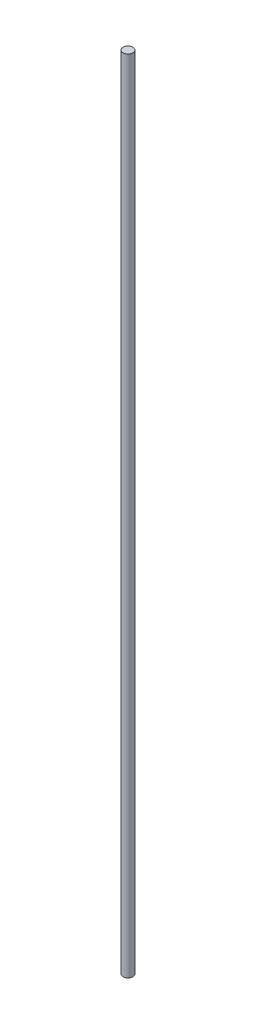
ISO-10303-21;
HEADER;
FILE_DESCRIPTION(('STEP AP214'),'2;1');
FILE_NAME('part.step','',(''),(''),'','','');
FILE_SCHEMA(('AUTOMOTIVE_DESIGN { 1 0 10303 214 1 1 1 1 }'));
ENDSEC;
DATA;
#1=APPLICATION_CONTEXT('core data for automotive mechanical design processes');
#2=APPLICATION_PROTOCOL_DEFINITION('international standard','automotive_design',2000,#1);
#3=PRODUCT_CONTEXT('',#1,'mechanical');
#4=PRODUCT('Part','Part','',(#3));
#5=PRODUCT_RELATED_PRODUCT_CATEGORY('part','',(#4));
#6=PRODUCT_DEFINITION_FORMATION('','',#4);
#7=PRODUCT_DEFINITION_CONTEXT('part definition',#1,'design');
#8=PRODUCT_DEFINITION('design','',#6,#7);
#9=PRODUCT_DEFINITION_SHAPE('','',#8);
#10=(LENGTH_UNIT() NAMED_UNIT(*) SI_UNIT(.MILLI.,.METRE.));
#11=(NAMED_UNIT(*) PLANE_ANGLE_UNIT() SI_UNIT($,.RADIAN.));
#12=(NAMED_UNIT(*) SI_UNIT($,.STERADIAN.) SOLID_ANGLE_UNIT());
#13=UNCERTAINTY_MEASURE_WITH_UNIT(LENGTH_MEASURE(1.E-05),#10,'distance_accuracy_value','');
#14=(GEOMETRIC_REPRESENTATION_CONTEXT(3) GLOBAL_UNCERTAINTY_ASSIGNED_CONTEXT((#13)) GLOBAL_UNIT_ASSIGNED_CONTEXT((#10,
#11,#12)) REPRESENTATION_CONTEXT('',''));
#15=CARTESIAN_POINT('',(0.,0.,0.));
#16=DIRECTION('',(0.,0.,1.));
#17=DIRECTION('',(1.,0.,0.));
#18=AXIS2_PLACEMENT_3D('',#15,#16,#17);
#19=CARTESIAN_POINT('',(0.,650.,0.));
#20=DIRECTION('',(0.,-1.,0.));
#21=DIRECTION('',(0.,0.,-1.));
#22=AXIS2_PLACEMENT_3D('',#19,#20,#21);
#23=CYLINDRICAL_SURFACE('',#22,4.);
#24=CARTESIAN_POINT('',(0.,650.,0.));
#25=DIRECTION('',(0.,1.,0.));
#26=DIRECTION('',(0.,0.,1.));
#27=AXIS2_PLACEMENT_3D('',#24,#25,#26);
#28=CIRCLE('',#27,4.);
#29=CARTESIAN_POINT('',(0.,650.,4.));
#30=VERTEX_POINT('',#29);
#31=EDGE_CURVE('E10',#30,#30,#28,.T.);
#32=ORIENTED_EDGE('',*,*,#31,.F.);
#33=EDGE_LOOP('',(#32));
#34=FACE_BOUND('',#33,.T.);
#35=CARTESIAN_POINT('',(0.,0.,0.));
#36=DIRECTION('',(0.,1.,0.));
#37=DIRECTION('',(0.,0.,1.));
#38=AXIS2_PLACEMENT_3D('',#35,#36,#37);
#39=CIRCLE('',#38,4.);
#40=CARTESIAN_POINT('',(0.,0.,4.));
#41=VERTEX_POINT('',#40);
#42=EDGE_CURVE('E33',#41,#41,#39,.T.);
#43=ORIENTED_EDGE('',*,*,#42,.T.);
#44=EDGE_LOOP('',(#43));
#45=FACE_BOUND('',#44,.T.);
#46=ADVANCED_FACE('F30',(#34,#45),#23,.T.);
#47=CARTESIAN_POINT('',(0.,650.,0.));
#48=DIRECTION('',(0.,1.,0.));
#49=DIRECTION('',(0.,0.,1.));
#50=AXIS2_PLACEMENT_3D('',#47,#48,#49);
#51=PLANE('',#50);
#52=ORIENTED_EDGE('',*,*,#31,.T.);
#53=EDGE_LOOP('',(#52));
#54=FACE_BOUND('',#53,.T.);
#55=ADVANCED_FACE('F45',(#54),#51,.T.);
#56=CARTESIAN_POINT('',(0.,0.,0.));
#57=DIRECTION('',(0.,1.,0.));
#58=DIRECTION('',(0.,0.,1.));
#59=AXIS2_PLACEMENT_3D('',#56,#57,#58);
#60=PLANE('',#59);
#61=ORIENTED_EDGE('',*,*,#42,.F.);
#62=EDGE_LOOP('',(#61));
#63=FACE_BOUND('',#62,.T.);
#64=ADVANCED_FACE('F43',(#63),#60,.F.);
#65=CLOSED_SHELL('',(#46,#55,#64));
#66=MANIFOLD_SOLID_BREP('B2',#65);
#67=ADVANCED_BREP_SHAPE_REPRESENTATION('',(#18,#66),#14);
#68=SHAPE_DEFINITION_REPRESENTATION(#9,#67);
ENDSEC;
END-ISO-10303-21;
